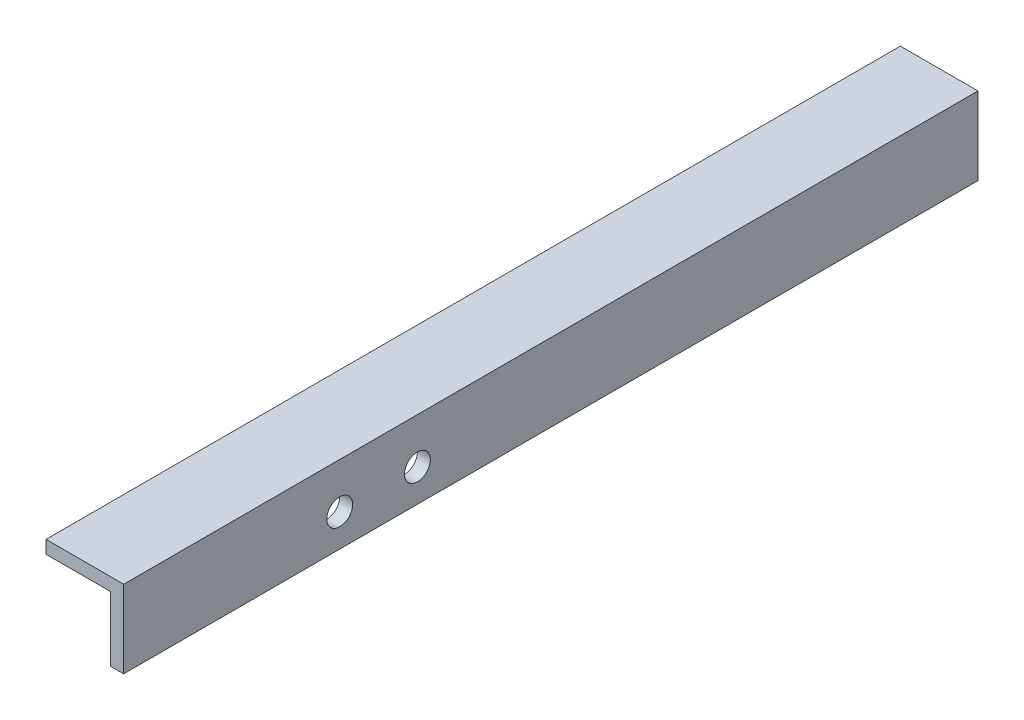
ISO-10303-21;
HEADER;
FILE_DESCRIPTION(('STEP AP214'),'2;1');
FILE_NAME('part.step','',(''),(''),'','','');
FILE_SCHEMA(('AUTOMOTIVE_DESIGN { 1 0 10303 214 1 1 1 1 }'));
ENDSEC;
DATA;
#1=APPLICATION_CONTEXT('core data for automotive mechanical design processes');
#2=APPLICATION_PROTOCOL_DEFINITION('international standard','automotive_design',2000,#1);
#3=PRODUCT_CONTEXT('',#1,'mechanical');
#4=PRODUCT('Part','Part','',(#3));
#5=PRODUCT_RELATED_PRODUCT_CATEGORY('part','',(#4));
#6=PRODUCT_DEFINITION_FORMATION('','',#4);
#7=PRODUCT_DEFINITION_CONTEXT('part definition',#1,'design');
#8=PRODUCT_DEFINITION('design','',#6,#7);
#9=PRODUCT_DEFINITION_SHAPE('','',#8);
#10=(LENGTH_UNIT() NAMED_UNIT(*) SI_UNIT(.MILLI.,.METRE.));
#11=(NAMED_UNIT(*) PLANE_ANGLE_UNIT() SI_UNIT($,.RADIAN.));
#12=(NAMED_UNIT(*) SI_UNIT($,.STERADIAN.) SOLID_ANGLE_UNIT());
#13=UNCERTAINTY_MEASURE_WITH_UNIT(LENGTH_MEASURE(1.E-05),#10,'distance_accuracy_value','');
#14=(GEOMETRIC_REPRESENTATION_CONTEXT(3) GLOBAL_UNCERTAINTY_ASSIGNED_CONTEXT((#13)) GLOBAL_UNIT_ASSIGNED_CONTEXT((#10,
#11,#12)) REPRESENTATION_CONTEXT('',''));
#15=CARTESIAN_POINT('',(0.,0.,0.));
#16=DIRECTION('',(0.,0.,1.));
#17=DIRECTION('',(1.,0.,0.));
#18=AXIS2_PLACEMENT_3D('',#15,#16,#17);
#19=CARTESIAN_POINT('',(-269.875,946.3,269.781536726415));
#20=DIRECTION('',(-1.,0.,0.));
#21=DIRECTION('',(0.,0.,1.));
#22=AXIS2_PLACEMENT_3D('',#19,#20,#21);
#23=PLANE('',#22);
#24=CARTESIAN_POINT('',(-269.875,962.175000000001,71.8088744611093));
#25=DIRECTION('',(-1.,0.,0.));
#26=DIRECTION('',(0.,0.,1.));
#27=AXIS2_PLACEMENT_3D('',#24,#25,#26);
#28=CIRCLE('',#27,6.34999999999997);
#29=CARTESIAN_POINT('',(-269.875,962.175000000001,78.1588744611092));
#30=VERTEX_POINT('',#29);
#31=EDGE_CURVE('E180',#30,#30,#28,.T.);
#32=ORIENTED_EDGE('',*,*,#31,.T.);
#33=EDGE_LOOP('',(#32));
#34=FACE_BOUND('',#33,.T.);
#35=CARTESIAN_POINT('',(-269.875,962.175000000001,109.908874461109));
#36=DIRECTION('',(-1.,0.,0.));
#37=DIRECTION('',(0.,0.,1.));
#38=AXIS2_PLACEMENT_3D('',#35,#36,#37);
#39=CIRCLE('',#38,6.35000000000006);
#40=CARTESIAN_POINT('',(-269.875,962.175000000001,116.258874461109));
#41=VERTEX_POINT('',#40);
#42=EDGE_CURVE('E125',#41,#41,#39,.T.);
#43=ORIENTED_EDGE('',*,*,#42,.T.);
#44=EDGE_LOOP('',(#43));
#45=FACE_BOUND('',#44,.T.);
#46=DIRECTION('',(0.,0.,-1.));
#47=VECTOR('',#46,1.);
#48=CARTESIAN_POINT('',(-269.875,984.4,269.781536726415));
#49=LINE('',#48,#47);
#50=CARTESIAN_POINT('',(-269.875,984.4,215.9));
#51=VERTEX_POINT('',#50);
#52=CARTESIAN_POINT('',(-269.875,984.4,-203.2));
#53=VERTEX_POINT('',#52);
#54=EDGE_CURVE('E144',#51,#53,#49,.T.);
#55=ORIENTED_EDGE('',*,*,#54,.F.);
#56=DIRECTION('',(0.,-1.,0.));
#57=VECTOR('',#56,1.);
#58=CARTESIAN_POINT('',(-269.875,946.3,215.9));
#59=LINE('',#58,#57);
#60=CARTESIAN_POINT('',(-269.875,946.3,215.9));
#61=VERTEX_POINT('',#60);
#62=EDGE_CURVE('E42',#51,#61,#59,.T.);
#63=ORIENTED_EDGE('',*,*,#62,.T.);
#64=DIRECTION('',(0.,0.,-1.));
#65=VECTOR('',#64,1.);
#66=CARTESIAN_POINT('',(-269.875,946.3,269.781536726415));
#67=LINE('',#66,#65);
#68=CARTESIAN_POINT('',(-269.875,946.3,-203.2));
#69=VERTEX_POINT('',#68);
#70=EDGE_CURVE('E147',#61,#69,#67,.T.);
#71=ORIENTED_EDGE('',*,*,#70,.T.);
#72=DIRECTION('',(0.,-1.,0.));
#73=VECTOR('',#72,1.);
#74=CARTESIAN_POINT('',(-269.875,946.3,-203.2));
#75=LINE('',#74,#73);
#76=EDGE_CURVE('E172',#53,#69,#75,.T.);
#77=ORIENTED_EDGE('',*,*,#76,.F.);
#78=EDGE_LOOP('',(#55,#63,#71,#77));
#79=FACE_BOUND('',#78,.T.);
#80=ADVANCED_FACE('F38',(#34,#45,#79),#23,.F.);
#81=CARTESIAN_POINT('',(-269.875,946.3,269.781536726415));
#82=DIRECTION('',(0.,-1.,0.));
#83=DIRECTION('',(0.,0.,-1.));
#84=AXIS2_PLACEMENT_3D('',#81,#82,#83);
#85=PLANE('',#84);
#86=DIRECTION('',(1.,0.,0.));
#87=VECTOR('',#86,1.);
#88=CARTESIAN_POINT('',(-269.875,946.3,215.9));
#89=LINE('',#88,#87);
#90=CARTESIAN_POINT('',(-276.225,946.3,215.9));
#91=VERTEX_POINT('',#90);
#92=EDGE_CURVE('E135',#91,#61,#89,.T.);
#93=ORIENTED_EDGE('',*,*,#92,.F.);
#94=DIRECTION('',(0.,0.,-1.));
#95=VECTOR('',#94,1.);
#96=CARTESIAN_POINT('',(-276.225,946.3,269.781536726415));
#97=LINE('',#96,#95);
#98=CARTESIAN_POINT('',(-276.225,946.3,-203.2));
#99=VERTEX_POINT('',#98);
#100=EDGE_CURVE('E150',#91,#99,#97,.T.);
#101=ORIENTED_EDGE('',*,*,#100,.T.);
#102=DIRECTION('',(1.,0.,0.));
#103=VECTOR('',#102,1.);
#104=CARTESIAN_POINT('',(-269.875,946.3,-203.2));
#105=LINE('',#104,#103);
#106=EDGE_CURVE('E171',#99,#69,#105,.T.);
#107=ORIENTED_EDGE('',*,*,#106,.T.);
#108=ORIENTED_EDGE('',*,*,#70,.F.);
#109=EDGE_LOOP('',(#93,#101,#107,#108));
#110=FACE_BOUND('',#109,.T.);
#111=ADVANCED_FACE('F170',(#110),#85,.T.);
#112=CARTESIAN_POINT('',(-276.225,946.3,269.781536726415));
#113=DIRECTION('',(-1.,0.,0.));
#114=DIRECTION('',(0.,0.,1.));
#115=AXIS2_PLACEMENT_3D('',#112,#113,#114);
#116=PLANE('',#115);
#117=CARTESIAN_POINT('',(-276.225,962.175000000001,71.8088744611093));
#118=DIRECTION('',(-1.,0.,0.));
#119=DIRECTION('',(0.,0.,1.));
#120=AXIS2_PLACEMENT_3D('',#117,#118,#119);
#121=CIRCLE('',#120,6.34999999999997);
#122=CARTESIAN_POINT('',(-276.225,962.175000000001,78.1588744611092));
#123=VERTEX_POINT('',#122);
#124=EDGE_CURVE('E182',#123,#123,#121,.T.);
#125=ORIENTED_EDGE('',*,*,#124,.F.);
#126=EDGE_LOOP('',(#125));
#127=FACE_BOUND('',#126,.T.);
#128=CARTESIAN_POINT('',(-276.225,962.175000000001,109.908874461109));
#129=DIRECTION('',(-1.,0.,0.));
#130=DIRECTION('',(0.,0.,1.));
#131=AXIS2_PLACEMENT_3D('',#128,#129,#130);
#132=CIRCLE('',#131,6.35000000000006);
#133=CARTESIAN_POINT('',(-276.225,962.175000000001,116.258874461109));
#134=VERTEX_POINT('',#133);
#135=EDGE_CURVE('E129',#134,#134,#132,.T.);
#136=ORIENTED_EDGE('',*,*,#135,.F.);
#137=EDGE_LOOP('',(#136));
#138=FACE_BOUND('',#137,.T.);
#139=DIRECTION('',(0.,-1.,0.));
#140=VECTOR('',#139,1.);
#141=CARTESIAN_POINT('',(-276.225,946.3,215.9));
#142=LINE('',#141,#140);
#143=CARTESIAN_POINT('',(-276.225,978.05,215.9));
#144=VERTEX_POINT('',#143);
#145=EDGE_CURVE('E60',#144,#91,#142,.T.);
#146=ORIENTED_EDGE('',*,*,#145,.F.);
#147=DIRECTION('',(0.,0.,-1.));
#148=VECTOR('',#147,1.);
#149=CARTESIAN_POINT('',(-276.225,978.05,269.781536726415));
#150=LINE('',#149,#148);
#151=CARTESIAN_POINT('',(-276.225,978.05,-203.2));
#152=VERTEX_POINT('',#151);
#153=EDGE_CURVE('E109',#144,#152,#150,.T.);
#154=ORIENTED_EDGE('',*,*,#153,.T.);
#155=DIRECTION('',(0.,-1.,0.));
#156=VECTOR('',#155,1.);
#157=CARTESIAN_POINT('',(-276.225,946.3,-203.2));
#158=LINE('',#157,#156);
#159=EDGE_CURVE('E120',#152,#99,#158,.T.);
#160=ORIENTED_EDGE('',*,*,#159,.T.);
#161=ORIENTED_EDGE('',*,*,#100,.F.);
#162=EDGE_LOOP('',(#146,#154,#160,#161));
#163=FACE_BOUND('',#162,.T.);
#164=ADVANCED_FACE('F167',(#127,#138,#163),#116,.T.);
#165=CARTESIAN_POINT('',(-269.875,978.05,269.781536726415));
#166=DIRECTION('',(0.,-1.,0.));
#167=DIRECTION('',(0.,0.,-1.));
#168=AXIS2_PLACEMENT_3D('',#165,#166,#167);
#169=PLANE('',#168);
#170=DIRECTION('',(1.,0.,0.));
#171=VECTOR('',#170,1.);
#172=CARTESIAN_POINT('',(-269.875,978.05,215.9));
#173=LINE('',#172,#171);
#174=CARTESIAN_POINT('',(-307.975,978.05,215.9));
#175=VERTEX_POINT('',#174);
#176=EDGE_CURVE('E103',#175,#144,#173,.T.);
#177=ORIENTED_EDGE('',*,*,#176,.F.);
#178=DIRECTION('',(0.,0.,-1.));
#179=VECTOR('',#178,1.);
#180=CARTESIAN_POINT('',(-307.975,978.05,269.781536726415));
#181=LINE('',#180,#179);
#182=CARTESIAN_POINT('',(-307.975,978.05,-203.2));
#183=VERTEX_POINT('',#182);
#184=EDGE_CURVE('E98',#175,#183,#181,.T.);
#185=ORIENTED_EDGE('',*,*,#184,.T.);
#186=DIRECTION('',(1.,0.,0.));
#187=VECTOR('',#186,1.);
#188=CARTESIAN_POINT('',(-269.875,978.05,-203.2));
#189=LINE('',#188,#187);
#190=EDGE_CURVE('E102',#183,#152,#189,.T.);
#191=ORIENTED_EDGE('',*,*,#190,.T.);
#192=ORIENTED_EDGE('',*,*,#153,.F.);
#193=EDGE_LOOP('',(#177,#185,#191,#192));
#194=FACE_BOUND('',#193,.T.);
#195=ADVANCED_FACE('F100',(#194),#169,.T.);
#196=CARTESIAN_POINT('',(-307.975,978.05,269.781536726415));
#197=DIRECTION('',(-1.,0.,0.));
#198=DIRECTION('',(0.,0.,1.));
#199=AXIS2_PLACEMENT_3D('',#196,#197,#198);
#200=PLANE('',#199);
#201=DIRECTION('',(0.,-1.,0.));
#202=VECTOR('',#201,1.);
#203=CARTESIAN_POINT('',(-307.975,978.05,215.9));
#204=LINE('',#203,#202);
#205=CARTESIAN_POINT('',(-307.975,984.4,215.9));
#206=VERTEX_POINT('',#205);
#207=EDGE_CURVE('E49',#206,#175,#204,.T.);
#208=ORIENTED_EDGE('',*,*,#207,.F.);
#209=DIRECTION('',(0.,0.,-1.));
#210=VECTOR('',#209,1.);
#211=CARTESIAN_POINT('',(-307.975,984.4,269.781536726415));
#212=LINE('',#211,#210);
#213=CARTESIAN_POINT('',(-307.975,984.4,-203.2));
#214=VERTEX_POINT('',#213);
#215=EDGE_CURVE('E108',#206,#214,#212,.T.);
#216=ORIENTED_EDGE('',*,*,#215,.T.);
#217=DIRECTION('',(0.,-1.,0.));
#218=VECTOR('',#217,1.);
#219=CARTESIAN_POINT('',(-307.975,978.05,-203.2));
#220=LINE('',#219,#218);
#221=EDGE_CURVE('E116',#214,#183,#220,.T.);
#222=ORIENTED_EDGE('',*,*,#221,.T.);
#223=ORIENTED_EDGE('',*,*,#184,.F.);
#224=EDGE_LOOP('',(#208,#216,#222,#223));
#225=FACE_BOUND('',#224,.T.);
#226=ADVANCED_FACE('F123',(#225),#200,.T.);
#227=CARTESIAN_POINT('',(-269.875,984.4,269.781536726415));
#228=DIRECTION('',(0.,-1.,0.));
#229=DIRECTION('',(0.,0.,-1.));
#230=AXIS2_PLACEMENT_3D('',#227,#228,#229);
#231=PLANE('',#230);
#232=ORIENTED_EDGE('',*,*,#215,.F.);
#233=DIRECTION('',(1.,0.,0.));
#234=VECTOR('',#233,1.);
#235=CARTESIAN_POINT('',(-269.875,984.4,215.9));
#236=LINE('',#235,#234);
#237=EDGE_CURVE('E11',#206,#51,#236,.T.);
#238=ORIENTED_EDGE('',*,*,#237,.T.);
#239=ORIENTED_EDGE('',*,*,#54,.T.);
#240=DIRECTION('',(1.,0.,0.));
#241=VECTOR('',#240,1.);
#242=CARTESIAN_POINT('',(-269.875,984.4,-203.2));
#243=LINE('',#242,#241);
#244=EDGE_CURVE('E133',#214,#53,#243,.T.);
#245=ORIENTED_EDGE('',*,*,#244,.F.);
#246=EDGE_LOOP('',(#232,#238,#239,#245));
#247=FACE_BOUND('',#246,.T.);
#248=ADVANCED_FACE('F40',(#247),#231,.F.);
#249=CARTESIAN_POINT('',(-269.875,190.65,215.9));
#250=DIRECTION('',(0.,0.,-1.));
#251=DIRECTION('',(0.,1.,0.));
#252=AXIS2_PLACEMENT_3D('',#249,#250,#251);
#253=PLANE('',#252);
#254=ORIENTED_EDGE('',*,*,#207,.T.);
#255=ORIENTED_EDGE('',*,*,#176,.T.);
#256=ORIENTED_EDGE('',*,*,#145,.T.);
#257=ORIENTED_EDGE('',*,*,#92,.T.);
#258=ORIENTED_EDGE('',*,*,#62,.F.);
#259=ORIENTED_EDGE('',*,*,#237,.F.);
#260=EDGE_LOOP('',(#254,#255,#256,#257,#258,#259));
#261=FACE_BOUND('',#260,.T.);
#262=ADVANCED_FACE('F163',(#261),#253,.F.);
#263=CARTESIAN_POINT('',(-269.875,190.65,-203.2));
#264=DIRECTION('',(0.,0.,1.));
#265=DIRECTION('',(0.,-1.,0.));
#266=AXIS2_PLACEMENT_3D('',#263,#264,#265);
#267=PLANE('',#266);
#268=ORIENTED_EDGE('',*,*,#244,.T.);
#269=ORIENTED_EDGE('',*,*,#76,.T.);
#270=ORIENTED_EDGE('',*,*,#106,.F.);
#271=ORIENTED_EDGE('',*,*,#159,.F.);
#272=ORIENTED_EDGE('',*,*,#190,.F.);
#273=ORIENTED_EDGE('',*,*,#221,.F.);
#274=EDGE_LOOP('',(#268,#269,#270,#271,#272,#273));
#275=FACE_BOUND('',#274,.T.);
#276=ADVANCED_FACE('F115',(#275),#267,.F.);
#277=CARTESIAN_POINT('',(-269.875,962.175000000001,109.908874461109));
#278=DIRECTION('',(-1.,0.,0.));
#279=DIRECTION('',(0.,0.,1.));
#280=AXIS2_PLACEMENT_3D('',#277,#278,#279);
#281=CYLINDRICAL_SURFACE('',#280,6.35000000000006);
#282=ORIENTED_EDGE('',*,*,#42,.F.);
#283=EDGE_LOOP('',(#282));
#284=FACE_BOUND('',#283,.T.);
#285=ORIENTED_EDGE('',*,*,#135,.T.);
#286=EDGE_LOOP('',(#285));
#287=FACE_BOUND('',#286,.T.);
#288=ADVANCED_FACE('F195',(#284,#287),#281,.F.);
#289=CARTESIAN_POINT('',(-269.875,962.175000000001,71.8088744611093));
#290=DIRECTION('',(-1.,0.,0.));
#291=DIRECTION('',(0.,0.,1.));
#292=AXIS2_PLACEMENT_3D('',#289,#290,#291);
#293=CYLINDRICAL_SURFACE('',#292,6.34999999999997);
#294=ORIENTED_EDGE('',*,*,#31,.F.);
#295=EDGE_LOOP('',(#294));
#296=FACE_BOUND('',#295,.T.);
#297=ORIENTED_EDGE('',*,*,#124,.T.);
#298=EDGE_LOOP('',(#297));
#299=FACE_BOUND('',#298,.T.);
#300=ADVANCED_FACE('F192',(#296,#299),#293,.F.);
#301=CLOSED_SHELL('',(#80,#111,#164,#195,#226,#248,#262,#276,#288,#300));
#302=MANIFOLD_SOLID_BREP('B2',#301);
#303=ADVANCED_BREP_SHAPE_REPRESENTATION('',(#18,#302),#14);
#304=SHAPE_DEFINITION_REPRESENTATION(#9,#303);
ENDSEC;
END-ISO-10303-21;
